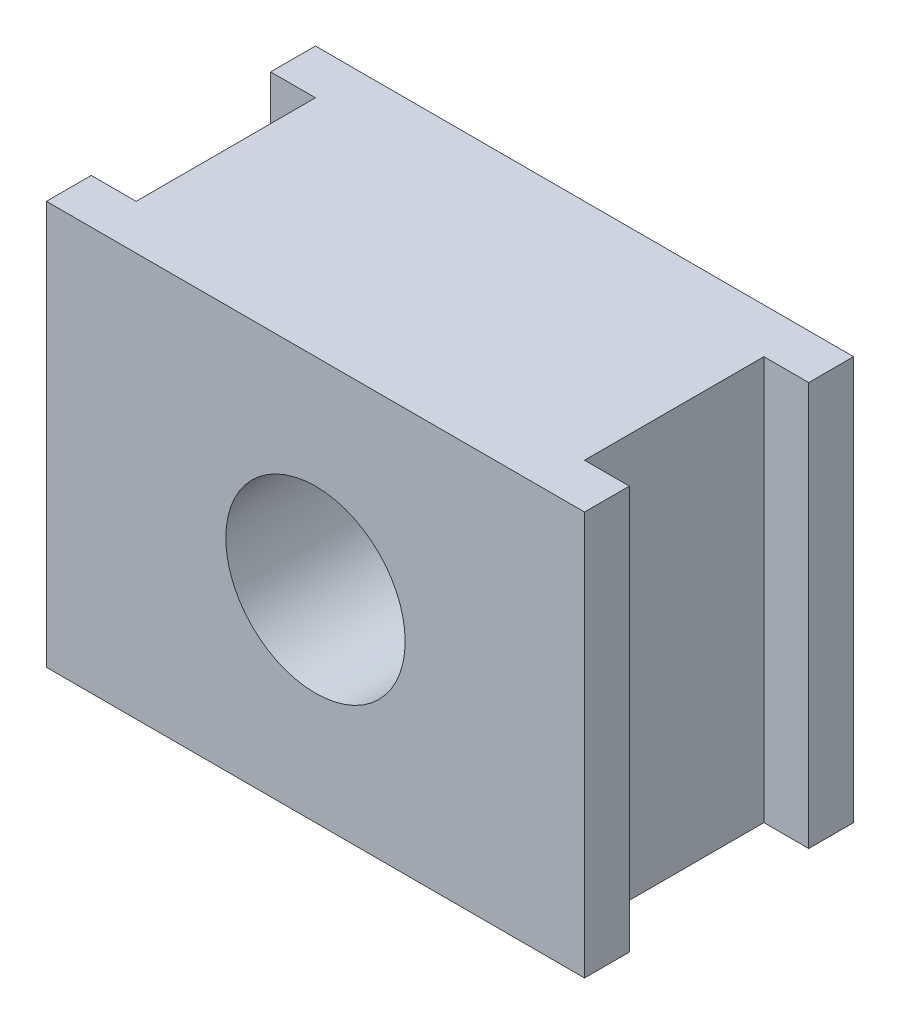
ISO-10303-21;
HEADER;
FILE_DESCRIPTION(('STEP AP214'),'2;1');
FILE_NAME('part.step','',(''),(''),'','','');
FILE_SCHEMA(('AUTOMOTIVE_DESIGN { 1 0 10303 214 1 1 1 1 }'));
ENDSEC;
DATA;
#1=APPLICATION_CONTEXT('core data for automotive mechanical design processes');
#2=APPLICATION_PROTOCOL_DEFINITION('international standard','automotive_design',2000,#1);
#3=PRODUCT_CONTEXT('',#1,'mechanical');
#4=PRODUCT('Part','Part','',(#3));
#5=PRODUCT_RELATED_PRODUCT_CATEGORY('part','',(#4));
#6=PRODUCT_DEFINITION_FORMATION('','',#4);
#7=PRODUCT_DEFINITION_CONTEXT('part definition',#1,'design');
#8=PRODUCT_DEFINITION('design','',#6,#7);
#9=PRODUCT_DEFINITION_SHAPE('','',#8);
#10=(LENGTH_UNIT() NAMED_UNIT(*) SI_UNIT(.MILLI.,.METRE.));
#11=(NAMED_UNIT(*) PLANE_ANGLE_UNIT() SI_UNIT($,.RADIAN.));
#12=(NAMED_UNIT(*) SI_UNIT($,.STERADIAN.) SOLID_ANGLE_UNIT());
#13=UNCERTAINTY_MEASURE_WITH_UNIT(LENGTH_MEASURE(1.E-05),#10,'distance_accuracy_value','');
#14=(GEOMETRIC_REPRESENTATION_CONTEXT(3) GLOBAL_UNCERTAINTY_ASSIGNED_CONTEXT((#13)) GLOBAL_UNIT_ASSIGNED_CONTEXT((#10,
#11,#12)) REPRESENTATION_CONTEXT('',''));
#15=CARTESIAN_POINT('',(0.,0.,0.));
#16=DIRECTION('',(0.,0.,1.));
#17=DIRECTION('',(1.,0.,0.));
#18=AXIS2_PLACEMENT_3D('',#15,#16,#17);
#19=CARTESIAN_POINT('',(30.,22.5,30.));
#20=DIRECTION('',(-1.,0.,0.));
#21=DIRECTION('',(0.,-1.,0.));
#22=AXIS2_PLACEMENT_3D('',#19,#20,#21);
#23=PLANE('',#22);
#24=DIRECTION('',(0.,0.,-1.));
#25=VECTOR('',#24,1.);
#26=CARTESIAN_POINT('',(30.,-22.5,30.));
#27=LINE('',#26,#25);
#28=CARTESIAN_POINT('',(30.,-22.5,30.));
#29=VERTEX_POINT('',#28);
#30=CARTESIAN_POINT('',(30.,-22.5,25.));
#31=VERTEX_POINT('',#30);
#32=EDGE_CURVE('E217',#29,#31,#27,.T.);
#33=ORIENTED_EDGE('',*,*,#32,.T.);
#34=DIRECTION('',(0.,1.,0.));
#35=VECTOR('',#34,1.);
#36=CARTESIAN_POINT('',(30.,22.5,25.));
#37=LINE('',#36,#35);
#38=CARTESIAN_POINT('',(30.,22.5,25.));
#39=VERTEX_POINT('',#38);
#40=EDGE_CURVE('E178',#31,#39,#37,.T.);
#41=ORIENTED_EDGE('',*,*,#40,.T.);
#42=DIRECTION('',(0.,0.,-1.));
#43=VECTOR('',#42,1.);
#44=CARTESIAN_POINT('',(30.,22.5,30.));
#45=LINE('',#44,#43);
#46=CARTESIAN_POINT('',(30.,22.5,30.));
#47=VERTEX_POINT('',#46);
#48=EDGE_CURVE('E231',#47,#39,#45,.T.);
#49=ORIENTED_EDGE('',*,*,#48,.F.);
#50=DIRECTION('',(0.,1.,0.));
#51=VECTOR('',#50,1.);
#52=CARTESIAN_POINT('',(30.,22.5,30.));
#53=LINE('',#52,#51);
#54=EDGE_CURVE('E189',#29,#47,#53,.T.);
#55=ORIENTED_EDGE('',*,*,#54,.F.);
#56=EDGE_LOOP('',(#33,#41,#49,#55));
#57=FACE_BOUND('',#56,.T.);
#58=ADVANCED_FACE('F37',(#57),#23,.F.);
#59=CARTESIAN_POINT('',(-30.,22.5,30.));
#60=DIRECTION('',(1.,0.,0.));
#61=DIRECTION('',(0.,1.,0.));
#62=AXIS2_PLACEMENT_3D('',#59,#60,#61);
#63=PLANE('',#62);
#64=DIRECTION('',(0.,0.,-1.));
#65=VECTOR('',#64,1.);
#66=CARTESIAN_POINT('',(-30.,22.5,30.));
#67=LINE('',#66,#65);
#68=CARTESIAN_POINT('',(-30.,22.5,30.));
#69=VERTEX_POINT('',#68);
#70=CARTESIAN_POINT('',(-30.,22.5,25.));
#71=VERTEX_POINT('',#70);
#72=EDGE_CURVE('E226',#69,#71,#67,.T.);
#73=ORIENTED_EDGE('',*,*,#72,.T.);
#74=DIRECTION('',(0.,-1.,0.));
#75=VECTOR('',#74,1.);
#76=CARTESIAN_POINT('',(-30.,22.5,25.));
#77=LINE('',#76,#75);
#78=CARTESIAN_POINT('',(-30.,-22.5,25.));
#79=VERTEX_POINT('',#78);
#80=EDGE_CURVE('E184',#71,#79,#77,.T.);
#81=ORIENTED_EDGE('',*,*,#80,.T.);
#82=DIRECTION('',(0.,0.,-1.));
#83=VECTOR('',#82,1.);
#84=CARTESIAN_POINT('',(-30.,-22.5,30.));
#85=LINE('',#84,#83);
#86=CARTESIAN_POINT('',(-30.,-22.5,30.));
#87=VERTEX_POINT('',#86);
#88=EDGE_CURVE('E222',#87,#79,#85,.T.);
#89=ORIENTED_EDGE('',*,*,#88,.F.);
#90=DIRECTION('',(0.,-1.,0.));
#91=VECTOR('',#90,1.);
#92=CARTESIAN_POINT('',(-30.,22.5,30.));
#93=LINE('',#92,#91);
#94=EDGE_CURVE('E197',#69,#87,#93,.T.);
#95=ORIENTED_EDGE('',*,*,#94,.F.);
#96=EDGE_LOOP('',(#73,#81,#89,#95));
#97=FACE_BOUND('',#96,.T.);
#98=ADVANCED_FACE('F258',(#97),#63,.F.);
#99=CARTESIAN_POINT('',(30.,22.5,5.00000000000001));
#100=VERTEX_POINT('',#99);
#101=CARTESIAN_POINT('',(30.,22.5,0.));
#102=VERTEX_POINT('',#101);
#103=EDGE_CURVE('E230',#100,#102,#45,.T.);
#104=ORIENTED_EDGE('',*,*,#103,.F.);
#105=DIRECTION('',(0.,-1.,0.));
#106=VECTOR('',#105,1.);
#107=CARTESIAN_POINT('',(30.,22.5,5.00000000000001));
#108=LINE('',#107,#106);
#109=CARTESIAN_POINT('',(30.,-22.5,5.00000000000001));
#110=VERTEX_POINT('',#109);
#111=EDGE_CURVE('E159',#100,#110,#108,.T.);
#112=ORIENTED_EDGE('',*,*,#111,.T.);
#113=CARTESIAN_POINT('',(30.,-22.5,0.));
#114=VERTEX_POINT('',#113);
#115=EDGE_CURVE('E203',#110,#114,#27,.T.);
#116=ORIENTED_EDGE('',*,*,#115,.T.);
#117=DIRECTION('',(0.,1.,0.));
#118=VECTOR('',#117,1.);
#119=CARTESIAN_POINT('',(30.,22.5,0.));
#120=LINE('',#119,#118);
#121=EDGE_CURVE('E188',#114,#102,#120,.T.);
#122=ORIENTED_EDGE('',*,*,#121,.T.);
#123=EDGE_LOOP('',(#104,#112,#116,#122));
#124=FACE_BOUND('',#123,.T.);
#125=ADVANCED_FACE('F39',(#124),#23,.F.);
#126=CARTESIAN_POINT('',(-30.,22.5,30.));
#127=DIRECTION('',(0.,-1.,0.));
#128=DIRECTION('',(0.,0.,-1.));
#129=AXIS2_PLACEMENT_3D('',#126,#127,#128);
#130=PLANE('',#129);
#131=DIRECTION('',(0.,0.,-1.));
#132=VECTOR('',#131,1.);
#133=CARTESIAN_POINT('',(-25.,22.5,5.00000000000002));
#134=LINE('',#133,#132);
#135=CARTESIAN_POINT('',(-25.,22.5,25.));
#136=VERTEX_POINT('',#135);
#137=CARTESIAN_POINT('',(-25.,22.5,5.00000000000002));
#138=VERTEX_POINT('',#137);
#139=EDGE_CURVE('E139',#136,#138,#134,.T.);
#140=ORIENTED_EDGE('',*,*,#139,.F.);
#141=DIRECTION('',(1.,0.,0.));
#142=VECTOR('',#141,1.);
#143=CARTESIAN_POINT('',(-40.,22.5,25.));
#144=LINE('',#143,#142);
#145=EDGE_CURVE('E136',#71,#136,#144,.T.);
#146=ORIENTED_EDGE('',*,*,#145,.F.);
#147=ORIENTED_EDGE('',*,*,#72,.F.);
#148=DIRECTION('',(-1.,0.,0.));
#149=VECTOR('',#148,1.);
#150=CARTESIAN_POINT('',(-30.,22.5,30.));
#151=LINE('',#150,#149);
#152=EDGE_CURVE('E193',#47,#69,#151,.T.);
#153=ORIENTED_EDGE('',*,*,#152,.F.);
#154=ORIENTED_EDGE('',*,*,#48,.T.);
#155=DIRECTION('',(1.,0.,0.));
#156=VECTOR('',#155,1.);
#157=CARTESIAN_POINT('',(40.,22.5,25.));
#158=LINE('',#157,#156);
#159=CARTESIAN_POINT('',(25.,22.5,25.));
#160=VERTEX_POINT('',#159);
#161=EDGE_CURVE('E168',#160,#39,#158,.T.);
#162=ORIENTED_EDGE('',*,*,#161,.F.);
#163=DIRECTION('',(0.,0.,1.));
#164=VECTOR('',#163,1.);
#165=CARTESIAN_POINT('',(25.,22.5,5.00000000000001));
#166=LINE('',#165,#164);
#167=CARTESIAN_POINT('',(25.,22.5,5.00000000000001));
#168=VERTEX_POINT('',#167);
#169=EDGE_CURVE('E164',#168,#160,#166,.T.);
#170=ORIENTED_EDGE('',*,*,#169,.F.);
#171=DIRECTION('',(-1.,0.,0.));
#172=VECTOR('',#171,1.);
#173=CARTESIAN_POINT('',(40.,22.5,5.));
#174=LINE('',#173,#172);
#175=EDGE_CURVE('E161',#100,#168,#174,.T.);
#176=ORIENTED_EDGE('',*,*,#175,.F.);
#177=ORIENTED_EDGE('',*,*,#103,.T.);
#178=DIRECTION('',(-1.,0.,0.));
#179=VECTOR('',#178,1.);
#180=CARTESIAN_POINT('',(-30.,22.5,0.));
#181=LINE('',#180,#179);
#182=CARTESIAN_POINT('',(-30.,22.5,0.));
#183=VERTEX_POINT('',#182);
#184=EDGE_CURVE('E207',#102,#183,#181,.T.);
#185=ORIENTED_EDGE('',*,*,#184,.T.);
#186=CARTESIAN_POINT('',(-30.,22.5,5.00000000000002));
#187=VERTEX_POINT('',#186);
#188=EDGE_CURVE('E151',#187,#183,#67,.T.);
#189=ORIENTED_EDGE('',*,*,#188,.F.);
#190=DIRECTION('',(-1.,0.,0.));
#191=VECTOR('',#190,1.);
#192=CARTESIAN_POINT('',(-40.,22.5,5.00000000000002));
#193=LINE('',#192,#191);
#194=EDGE_CURVE('E130',#138,#187,#193,.T.);
#195=ORIENTED_EDGE('',*,*,#194,.F.);
#196=EDGE_LOOP('',(#140,#146,#147,#153,#154,#162,#170,#176,#177,#185,#189,#195));
#197=FACE_BOUND('',#196,.T.);
#198=ADVANCED_FACE('F149',(#197),#130,.F.);
#199=CARTESIAN_POINT('',(-30.,-22.5,5.00000000000002));
#200=VERTEX_POINT('',#199);
#201=CARTESIAN_POINT('',(-30.,-22.5,0.));
#202=VERTEX_POINT('',#201);
#203=EDGE_CURVE('E221',#200,#202,#85,.T.);
#204=ORIENTED_EDGE('',*,*,#203,.F.);
#205=DIRECTION('',(0.,1.,0.));
#206=VECTOR('',#205,1.);
#207=CARTESIAN_POINT('',(-30.,22.5,5.00000000000002));
#208=LINE('',#207,#206);
#209=EDGE_CURVE('E62',#200,#187,#208,.T.);
#210=ORIENTED_EDGE('',*,*,#209,.T.);
#211=ORIENTED_EDGE('',*,*,#188,.T.);
#212=DIRECTION('',(0.,-1.,0.));
#213=VECTOR('',#212,1.);
#214=CARTESIAN_POINT('',(-30.,22.5,0.));
#215=LINE('',#214,#213);
#216=EDGE_CURVE('E210',#183,#202,#215,.T.);
#217=ORIENTED_EDGE('',*,*,#216,.T.);
#218=EDGE_LOOP('',(#204,#210,#211,#217));
#219=FACE_BOUND('',#218,.T.);
#220=ADVANCED_FACE('F289',(#219),#63,.F.);
#221=CARTESIAN_POINT('',(-30.,-22.5,30.));
#222=DIRECTION('',(0.,1.,0.));
#223=DIRECTION('',(0.,0.,1.));
#224=AXIS2_PLACEMENT_3D('',#221,#222,#223);
#225=PLANE('',#224);
#226=ORIENTED_EDGE('',*,*,#88,.T.);
#227=DIRECTION('',(1.,0.,0.));
#228=VECTOR('',#227,1.);
#229=CARTESIAN_POINT('',(-30.,-22.5,25.));
#230=LINE('',#229,#228);
#231=CARTESIAN_POINT('',(-25.,-22.5,25.));
#232=VERTEX_POINT('',#231);
#233=EDGE_CURVE('E11',#79,#232,#230,.T.);
#234=ORIENTED_EDGE('',*,*,#233,.T.);
#235=DIRECTION('',(0.,0.,-1.));
#236=VECTOR('',#235,1.);
#237=CARTESIAN_POINT('',(-25.,-22.5,30.));
#238=LINE('',#237,#236);
#239=CARTESIAN_POINT('',(-25.,-22.5,5.00000000000002));
#240=VERTEX_POINT('',#239);
#241=EDGE_CURVE('E47',#232,#240,#238,.T.);
#242=ORIENTED_EDGE('',*,*,#241,.T.);
#243=DIRECTION('',(-1.,0.,0.));
#244=VECTOR('',#243,1.);
#245=CARTESIAN_POINT('',(-30.,-22.5,5.00000000000002));
#246=LINE('',#245,#244);
#247=EDGE_CURVE('E131',#240,#200,#246,.T.);
#248=ORIENTED_EDGE('',*,*,#247,.T.);
#249=ORIENTED_EDGE('',*,*,#203,.T.);
#250=DIRECTION('',(1.,0.,0.));
#251=VECTOR('',#250,1.);
#252=CARTESIAN_POINT('',(-30.,-22.5,0.));
#253=LINE('',#252,#251);
#254=EDGE_CURVE('E194',#202,#114,#253,.T.);
#255=ORIENTED_EDGE('',*,*,#254,.T.);
#256=ORIENTED_EDGE('',*,*,#115,.F.);
#257=DIRECTION('',(-1.,0.,0.));
#258=VECTOR('',#257,1.);
#259=CARTESIAN_POINT('',(-30.,-22.5,5.00000000000002));
#260=LINE('',#259,#258);
#261=CARTESIAN_POINT('',(25.,-22.5,5.00000000000001));
#262=VERTEX_POINT('',#261);
#263=EDGE_CURVE('E235',#110,#262,#260,.T.);
#264=ORIENTED_EDGE('',*,*,#263,.T.);
#265=DIRECTION('',(0.,0.,1.));
#266=VECTOR('',#265,1.);
#267=CARTESIAN_POINT('',(25.,-22.5,30.));
#268=LINE('',#267,#266);
#269=CARTESIAN_POINT('',(25.,-22.5,25.));
#270=VERTEX_POINT('',#269);
#271=EDGE_CURVE('E239',#262,#270,#268,.T.);
#272=ORIENTED_EDGE('',*,*,#271,.T.);
#273=DIRECTION('',(1.,0.,0.));
#274=VECTOR('',#273,1.);
#275=CARTESIAN_POINT('',(-30.,-22.5,25.));
#276=LINE('',#275,#274);
#277=EDGE_CURVE('E243',#270,#31,#276,.T.);
#278=ORIENTED_EDGE('',*,*,#277,.T.);
#279=ORIENTED_EDGE('',*,*,#32,.F.);
#280=DIRECTION('',(1.,0.,0.));
#281=VECTOR('',#280,1.);
#282=CARTESIAN_POINT('',(-30.,-22.5,30.));
#283=LINE('',#282,#281);
#284=EDGE_CURVE('E200',#87,#29,#283,.T.);
#285=ORIENTED_EDGE('',*,*,#284,.F.);
#286=EDGE_LOOP('',(#226,#234,#242,#248,#249,#255,#256,#264,#272,#278,#279,#285));
#287=FACE_BOUND('',#286,.T.);
#288=ADVANCED_FACE('F251',(#287),#225,.F.);
#289=CARTESIAN_POINT('',(0.,0.,30.));
#290=DIRECTION('',(0.,0.,1.));
#291=DIRECTION('',(1.,0.,0.));
#292=AXIS2_PLACEMENT_3D('',#289,#290,#291);
#293=PLANE('',#292);
#294=CARTESIAN_POINT('',(0.,0.,30.));
#295=DIRECTION('',(0.,0.,1.));
#296=DIRECTION('',(1.,0.,0.));
#297=AXIS2_PLACEMENT_3D('',#294,#295,#296);
#298=CIRCLE('',#297,10.);
#299=CARTESIAN_POINT('',(10.,0.,30.));
#300=VERTEX_POINT('',#299);
#301=EDGE_CURVE('E406',#300,#300,#298,.T.);
#302=ORIENTED_EDGE('',*,*,#301,.F.);
#303=EDGE_LOOP('',(#302));
#304=FACE_BOUND('',#303,.T.);
#305=ORIENTED_EDGE('',*,*,#54,.T.);
#306=ORIENTED_EDGE('',*,*,#152,.T.);
#307=ORIENTED_EDGE('',*,*,#94,.T.);
#308=ORIENTED_EDGE('',*,*,#284,.T.);
#309=EDGE_LOOP('',(#305,#306,#307,#308));
#310=FACE_BOUND('',#309,.T.);
#311=ADVANCED_FACE('F262',(#304,#310),#293,.T.);
#312=CARTESIAN_POINT('',(0.,0.,0.));
#313=DIRECTION('',(0.,0.,1.));
#314=DIRECTION('',(1.,0.,0.));
#315=AXIS2_PLACEMENT_3D('',#312,#313,#314);
#316=PLANE('',#315);
#317=CARTESIAN_POINT('',(0.,0.,0.));
#318=DIRECTION('',(0.,0.,1.));
#319=DIRECTION('',(1.,0.,0.));
#320=AXIS2_PLACEMENT_3D('',#317,#318,#319);
#321=CIRCLE('',#320,10.);
#322=CARTESIAN_POINT('',(10.,0.,0.));
#323=VERTEX_POINT('',#322);
#324=EDGE_CURVE('E41',#323,#323,#321,.T.);
#325=ORIENTED_EDGE('',*,*,#324,.T.);
#326=EDGE_LOOP('',(#325));
#327=FACE_BOUND('',#326,.T.);
#328=ORIENTED_EDGE('',*,*,#121,.F.);
#329=ORIENTED_EDGE('',*,*,#254,.F.);
#330=ORIENTED_EDGE('',*,*,#216,.F.);
#331=ORIENTED_EDGE('',*,*,#184,.F.);
#332=EDGE_LOOP('',(#328,#329,#330,#331));
#333=FACE_BOUND('',#332,.T.);
#334=ADVANCED_FACE('F287',(#327,#333),#316,.F.);
#335=CARTESIAN_POINT('',(40.,-57.5,25.));
#336=DIRECTION('',(0.,0.,1.));
#337=DIRECTION('',(1.,0.,0.));
#338=AXIS2_PLACEMENT_3D('',#335,#336,#337);
#339=PLANE('',#338);
#340=ORIENTED_EDGE('',*,*,#277,.F.);
#341=DIRECTION('',(0.,1.,0.));
#342=VECTOR('',#341,1.);
#343=CARTESIAN_POINT('',(25.,-57.5,25.));
#344=LINE('',#343,#342);
#345=EDGE_CURVE('E146',#270,#160,#344,.T.);
#346=ORIENTED_EDGE('',*,*,#345,.T.);
#347=ORIENTED_EDGE('',*,*,#161,.T.);
#348=ORIENTED_EDGE('',*,*,#40,.F.);
#349=EDGE_LOOP('',(#340,#346,#347,#348));
#350=FACE_BOUND('',#349,.T.);
#351=ADVANCED_FACE('F270',(#350),#339,.F.);
#352=CARTESIAN_POINT('',(25.,-57.5,5.00000000000001));
#353=DIRECTION('',(-1.,0.,0.));
#354=DIRECTION('',(0.,0.,1.));
#355=AXIS2_PLACEMENT_3D('',#352,#353,#354);
#356=PLANE('',#355);
#357=DIRECTION('',(0.,1.,0.));
#358=VECTOR('',#357,1.);
#359=CARTESIAN_POINT('',(25.,-57.5,5.00000000000001));
#360=LINE('',#359,#358);
#361=EDGE_CURVE('E54',#262,#168,#360,.T.);
#362=ORIENTED_EDGE('',*,*,#361,.T.);
#363=ORIENTED_EDGE('',*,*,#169,.T.);
#364=ORIENTED_EDGE('',*,*,#345,.F.);
#365=ORIENTED_EDGE('',*,*,#271,.F.);
#366=EDGE_LOOP('',(#362,#363,#364,#365));
#367=FACE_BOUND('',#366,.T.);
#368=ADVANCED_FACE('F274',(#367),#356,.F.);
#369=CARTESIAN_POINT('',(40.,-57.5,5.));
#370=DIRECTION('',(0.,0.,-1.));
#371=DIRECTION('',(-1.,0.,0.));
#372=AXIS2_PLACEMENT_3D('',#369,#370,#371);
#373=PLANE('',#372);
#374=ORIENTED_EDGE('',*,*,#175,.T.);
#375=ORIENTED_EDGE('',*,*,#361,.F.);
#376=ORIENTED_EDGE('',*,*,#263,.F.);
#377=ORIENTED_EDGE('',*,*,#111,.F.);
#378=EDGE_LOOP('',(#374,#375,#376,#377));
#379=FACE_BOUND('',#378,.T.);
#380=ADVANCED_FACE('F341',(#379),#373,.F.);
#381=CARTESIAN_POINT('',(-25.,-57.5,5.00000000000002));
#382=DIRECTION('',(1.,0.,0.));
#383=DIRECTION('',(0.,0.,-1.));
#384=AXIS2_PLACEMENT_3D('',#381,#382,#383);
#385=PLANE('',#384);
#386=DIRECTION('',(0.,1.,0.));
#387=VECTOR('',#386,1.);
#388=CARTESIAN_POINT('',(-25.,-57.5,25.));
#389=LINE('',#388,#387);
#390=EDGE_CURVE('E135',#232,#136,#389,.T.);
#391=ORIENTED_EDGE('',*,*,#390,.T.);
#392=ORIENTED_EDGE('',*,*,#139,.T.);
#393=DIRECTION('',(0.,1.,0.));
#394=VECTOR('',#393,1.);
#395=CARTESIAN_POINT('',(-25.,-57.5,5.00000000000002));
#396=LINE('',#395,#394);
#397=EDGE_CURVE('E126',#240,#138,#396,.T.);
#398=ORIENTED_EDGE('',*,*,#397,.F.);
#399=ORIENTED_EDGE('',*,*,#241,.F.);
#400=EDGE_LOOP('',(#391,#392,#398,#399));
#401=FACE_BOUND('',#400,.T.);
#402=ADVANCED_FACE('F140',(#401),#385,.F.);
#403=CARTESIAN_POINT('',(-40.,-57.5,25.));
#404=DIRECTION('',(0.,0.,1.));
#405=DIRECTION('',(1.,0.,0.));
#406=AXIS2_PLACEMENT_3D('',#403,#404,#405);
#407=PLANE('',#406);
#408=ORIENTED_EDGE('',*,*,#145,.T.);
#409=ORIENTED_EDGE('',*,*,#390,.F.);
#410=ORIENTED_EDGE('',*,*,#233,.F.);
#411=ORIENTED_EDGE('',*,*,#80,.F.);
#412=EDGE_LOOP('',(#408,#409,#410,#411));
#413=FACE_BOUND('',#412,.T.);
#414=ADVANCED_FACE('F254',(#413),#407,.F.);
#415=CARTESIAN_POINT('',(-40.,-57.5,5.00000000000002));
#416=DIRECTION('',(0.,0.,-1.));
#417=DIRECTION('',(-1.,0.,0.));
#418=AXIS2_PLACEMENT_3D('',#415,#416,#417);
#419=PLANE('',#418);
#420=ORIENTED_EDGE('',*,*,#247,.F.);
#421=ORIENTED_EDGE('',*,*,#397,.T.);
#422=ORIENTED_EDGE('',*,*,#194,.T.);
#423=ORIENTED_EDGE('',*,*,#209,.F.);
#424=EDGE_LOOP('',(#420,#421,#422,#423));
#425=FACE_BOUND('',#424,.T.);
#426=ADVANCED_FACE('F128',(#425),#419,.F.);
#427=CARTESIAN_POINT('',(0.,0.,-50.));
#428=DIRECTION('',(0.,0.,1.));
#429=DIRECTION('',(1.,0.,0.));
#430=AXIS2_PLACEMENT_3D('',#427,#428,#429);
#431=CYLINDRICAL_SURFACE('',#430,10.);
#432=ORIENTED_EDGE('',*,*,#301,.T.);
#433=EDGE_LOOP('',(#432));
#434=FACE_BOUND('',#433,.T.);
#435=ORIENTED_EDGE('',*,*,#324,.F.);
#436=EDGE_LOOP('',(#435));
#437=FACE_BOUND('',#436,.T.);
#438=ADVANCED_FACE('F374',(#434,#437),#431,.F.);
#439=CLOSED_SHELL('',(#58,#98,#125,#198,#220,#288,#311,#334,#351,#368,#380,#402,#414,#426,#438));
#440=MANIFOLD_SOLID_BREP('B2',#439);
#441=ADVANCED_BREP_SHAPE_REPRESENTATION('',(#18,#440),#14);
#442=SHAPE_DEFINITION_REPRESENTATION(#9,#441);
ENDSEC;
END-ISO-10303-21;
